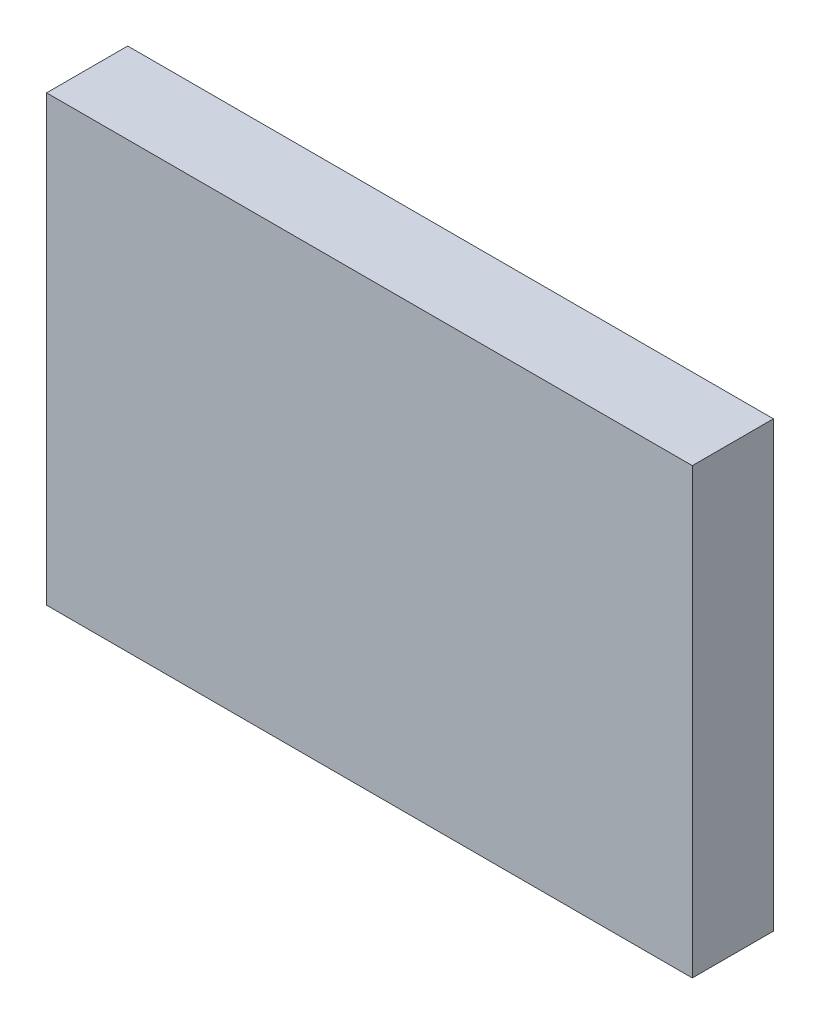
ISO-10303-21;
HEADER;
FILE_DESCRIPTION(('STEP AP214'),'2;1');
FILE_NAME('part.step','',(''),(''),'','','');
FILE_SCHEMA(('AUTOMOTIVE_DESIGN { 1 0 10303 214 1 1 1 1 }'));
ENDSEC;
DATA;
#1=APPLICATION_CONTEXT('core data for automotive mechanical design processes');
#2=APPLICATION_PROTOCOL_DEFINITION('international standard','automotive_design',2000,#1);
#3=PRODUCT_CONTEXT('',#1,'mechanical');
#4=PRODUCT('Part','Part','',(#3));
#5=PRODUCT_RELATED_PRODUCT_CATEGORY('part','',(#4));
#6=PRODUCT_DEFINITION_FORMATION('','',#4);
#7=PRODUCT_DEFINITION_CONTEXT('part definition',#1,'design');
#8=PRODUCT_DEFINITION('design','',#6,#7);
#9=PRODUCT_DEFINITION_SHAPE('','',#8);
#10=(LENGTH_UNIT() NAMED_UNIT(*) SI_UNIT(.MILLI.,.METRE.));
#11=(NAMED_UNIT(*) PLANE_ANGLE_UNIT() SI_UNIT($,.RADIAN.));
#12=(NAMED_UNIT(*) SI_UNIT($,.STERADIAN.) SOLID_ANGLE_UNIT());
#13=UNCERTAINTY_MEASURE_WITH_UNIT(LENGTH_MEASURE(1.E-05),#10,'distance_accuracy_value','');
#14=(GEOMETRIC_REPRESENTATION_CONTEXT(3) GLOBAL_UNCERTAINTY_ASSIGNED_CONTEXT((#13)) GLOBAL_UNIT_ASSIGNED_CONTEXT((#10,
#11,#12)) REPRESENTATION_CONTEXT('',''));
#15=CARTESIAN_POINT('',(0.,0.,0.));
#16=DIRECTION('',(0.,0.,1.));
#17=DIRECTION('',(1.,0.,0.));
#18=AXIS2_PLACEMENT_3D('',#15,#16,#17);
#19=CARTESIAN_POINT('',(1.143,0.318,0.));
#20=DIRECTION('',(0.,-1.,0.));
#21=DIRECTION('',(0.,0.,-1.));
#22=AXIS2_PLACEMENT_3D('',#19,#20,#21);
#23=PLANE('',#22);
#24=DIRECTION('',(-1.,0.,0.));
#25=VECTOR('',#24,1.);
#26=CARTESIAN_POINT('',(1.549,0.318,0.));
#27=LINE('',#26,#25);
#28=CARTESIAN_POINT('',(1.549,0.318,0.));
#29=VERTEX_POINT('',#28);
#30=CARTESIAN_POINT('',(1.143,0.318,0.));
#31=VERTEX_POINT('',#30);
#32=EDGE_CURVE('E11',#29,#31,#27,.T.);
#33=ORIENTED_EDGE('',*,*,#32,.F.);
#34=DIRECTION('',(0.,0.,-1.));
#35=VECTOR('',#34,1.);
#36=CARTESIAN_POINT('',(1.549,0.318,0.051));
#37=LINE('',#36,#35);
#38=CARTESIAN_POINT('',(1.549,0.318,0.051));
#39=VERTEX_POINT('',#38);
#40=EDGE_CURVE('E24',#39,#29,#37,.T.);
#41=ORIENTED_EDGE('',*,*,#40,.F.);
#42=DIRECTION('',(1.,0.,0.));
#43=VECTOR('',#42,1.);
#44=CARTESIAN_POINT('',(1.143,0.318,0.051));
#45=LINE('',#44,#43);
#46=CARTESIAN_POINT('',(1.143,0.318,0.051));
#47=VERTEX_POINT('',#46);
#48=EDGE_CURVE('E88',#47,#39,#45,.T.);
#49=ORIENTED_EDGE('',*,*,#48,.F.);
#50=DIRECTION('',(0.,0.,1.));
#51=VECTOR('',#50,1.);
#52=CARTESIAN_POINT('',(1.143,0.318,0.));
#53=LINE('',#52,#51);
#54=EDGE_CURVE('E77',#31,#47,#53,.T.);
#55=ORIENTED_EDGE('',*,*,#54,.F.);
#56=EDGE_LOOP('',(#33,#41,#49,#55));
#57=FACE_BOUND('',#56,.T.);
#58=ADVANCED_FACE('F17',(#57),#23,.T.);
#59=CARTESIAN_POINT('',(1.549,0.318,0.));
#60=DIRECTION('',(1.,0.,0.));
#61=DIRECTION('',(0.,1.,0.));
#62=AXIS2_PLACEMENT_3D('',#59,#60,#61);
#63=PLANE('',#62);
#64=DIRECTION('',(0.,-1.,0.));
#65=VECTOR('',#64,1.);
#66=CARTESIAN_POINT('',(1.549,0.597,0.));
#67=LINE('',#66,#65);
#68=CARTESIAN_POINT('',(1.549,0.597,0.));
#69=VERTEX_POINT('',#68);
#70=EDGE_CURVE('E85',#69,#29,#67,.T.);
#71=ORIENTED_EDGE('',*,*,#70,.F.);
#72=DIRECTION('',(0.,0.,-1.));
#73=VECTOR('',#72,1.);
#74=CARTESIAN_POINT('',(1.549,0.597,0.051));
#75=LINE('',#74,#73);
#76=CARTESIAN_POINT('',(1.549,0.597,0.051));
#77=VERTEX_POINT('',#76);
#78=EDGE_CURVE('E83',#77,#69,#75,.T.);
#79=ORIENTED_EDGE('',*,*,#78,.F.);
#80=DIRECTION('',(0.,1.,0.));
#81=VECTOR('',#80,1.);
#82=CARTESIAN_POINT('',(1.549,0.318,0.051));
#83=LINE('',#82,#81);
#84=EDGE_CURVE('E72',#39,#77,#83,.T.);
#85=ORIENTED_EDGE('',*,*,#84,.F.);
#86=ORIENTED_EDGE('',*,*,#40,.T.);
#87=EDGE_LOOP('',(#71,#79,#85,#86));
#88=FACE_BOUND('',#87,.T.);
#89=ADVANCED_FACE('F90',(#88),#63,.T.);
#90=CARTESIAN_POINT('',(1.549,0.597,0.));
#91=DIRECTION('',(0.,1.,0.));
#92=DIRECTION('',(1.,0.,0.));
#93=AXIS2_PLACEMENT_3D('',#90,#91,#92);
#94=PLANE('',#93);
#95=DIRECTION('',(1.,0.,0.));
#96=VECTOR('',#95,1.);
#97=CARTESIAN_POINT('',(1.143,0.597,0.));
#98=LINE('',#97,#96);
#99=CARTESIAN_POINT('',(1.143,0.597,0.));
#100=VERTEX_POINT('',#99);
#101=EDGE_CURVE('E60',#100,#69,#98,.T.);
#102=ORIENTED_EDGE('',*,*,#101,.F.);
#103=DIRECTION('',(0.,0.,-1.));
#104=VECTOR('',#103,1.);
#105=CARTESIAN_POINT('',(1.143,0.597,0.051));
#106=LINE('',#105,#104);
#107=CARTESIAN_POINT('',(1.143,0.597,0.051));
#108=VERTEX_POINT('',#107);
#109=EDGE_CURVE('E54',#108,#100,#106,.T.);
#110=ORIENTED_EDGE('',*,*,#109,.F.);
#111=DIRECTION('',(-1.,0.,0.));
#112=VECTOR('',#111,1.);
#113=CARTESIAN_POINT('',(1.549,0.597,0.051));
#114=LINE('',#113,#112);
#115=EDGE_CURVE('E58',#77,#108,#114,.T.);
#116=ORIENTED_EDGE('',*,*,#115,.F.);
#117=ORIENTED_EDGE('',*,*,#78,.T.);
#118=EDGE_LOOP('',(#102,#110,#116,#117));
#119=FACE_BOUND('',#118,.T.);
#120=ADVANCED_FACE('F56',(#119),#94,.T.);
#121=CARTESIAN_POINT('',(1.143,0.597,0.));
#122=DIRECTION('',(-1.,0.,0.));
#123=DIRECTION('',(0.,0.,1.));
#124=AXIS2_PLACEMENT_3D('',#121,#122,#123);
#125=PLANE('',#124);
#126=DIRECTION('',(0.,1.,0.));
#127=VECTOR('',#126,1.);
#128=CARTESIAN_POINT('',(1.143,0.318,0.));
#129=LINE('',#128,#127);
#130=EDGE_CURVE('E73',#31,#100,#129,.T.);
#131=ORIENTED_EDGE('',*,*,#130,.F.);
#132=ORIENTED_EDGE('',*,*,#54,.T.);
#133=DIRECTION('',(0.,-1.,0.));
#134=VECTOR('',#133,1.);
#135=CARTESIAN_POINT('',(1.143,0.597,0.051));
#136=LINE('',#135,#134);
#137=EDGE_CURVE('E70',#108,#47,#136,.T.);
#138=ORIENTED_EDGE('',*,*,#137,.F.);
#139=ORIENTED_EDGE('',*,*,#109,.T.);
#140=EDGE_LOOP('',(#131,#132,#138,#139));
#141=FACE_BOUND('',#140,.T.);
#142=ADVANCED_FACE('F76',(#141),#125,.T.);
#143=CARTESIAN_POINT('',(1.143,0.597,0.));
#144=DIRECTION('',(0.,0.,-1.));
#145=DIRECTION('',(0.,-1.,0.));
#146=AXIS2_PLACEMENT_3D('',#143,#144,#145);
#147=PLANE('',#146);
#148=ORIENTED_EDGE('',*,*,#101,.T.);
#149=ORIENTED_EDGE('',*,*,#70,.T.);
#150=ORIENTED_EDGE('',*,*,#32,.T.);
#151=ORIENTED_EDGE('',*,*,#130,.T.);
#152=EDGE_LOOP('',(#148,#149,#150,#151));
#153=FACE_BOUND('',#152,.T.);
#154=ADVANCED_FACE('F91',(#153),#147,.T.);
#155=CARTESIAN_POINT('',(1.143,0.318,0.051));
#156=DIRECTION('',(0.,0.,1.));
#157=DIRECTION('',(1.,0.,0.));
#158=AXIS2_PLACEMENT_3D('',#155,#156,#157);
#159=PLANE('',#158);
#160=ORIENTED_EDGE('',*,*,#48,.T.);
#161=ORIENTED_EDGE('',*,*,#84,.T.);
#162=ORIENTED_EDGE('',*,*,#115,.T.);
#163=ORIENTED_EDGE('',*,*,#137,.T.);
#164=EDGE_LOOP('',(#160,#161,#162,#163));
#165=FACE_BOUND('',#164,.T.);
#166=ADVANCED_FACE('F69',(#165),#159,.T.);
#167=CLOSED_SHELL('',(#58,#89,#120,#142,#154,#166));
#168=MANIFOLD_SOLID_BREP('B1',#167);
#169=ADVANCED_BREP_SHAPE_REPRESENTATION('',(#18,#168),#14);
#170=SHAPE_DEFINITION_REPRESENTATION(#9,#169);
ENDSEC;
END-ISO-10303-21;
